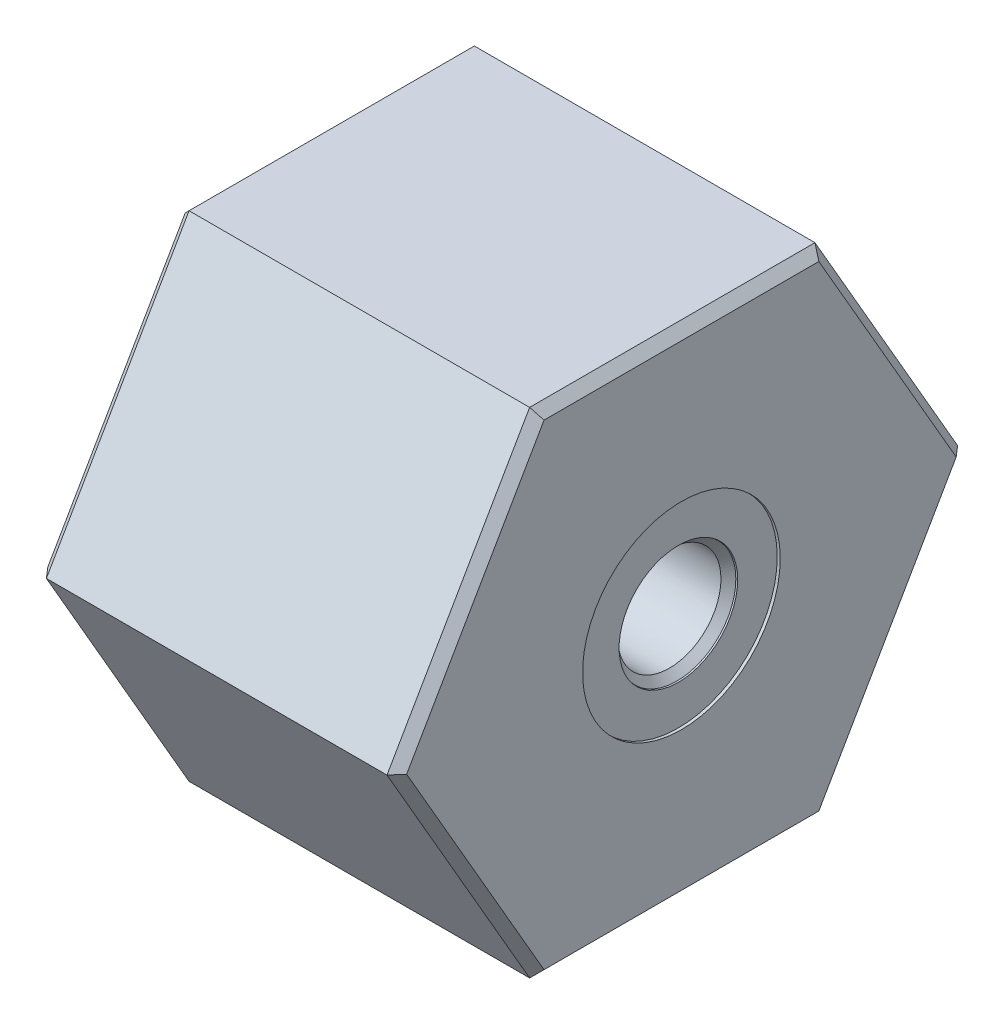
ISO-10303-21;
HEADER;
FILE_DESCRIPTION(('STEP AP214'),'2;1');
FILE_NAME('part.step','',(''),(''),'','','');
FILE_SCHEMA(('AUTOMOTIVE_DESIGN { 1 0 10303 214 1 1 1 1 }'));
ENDSEC;
DATA;
#1=APPLICATION_CONTEXT('core data for automotive mechanical design processes');
#2=APPLICATION_PROTOCOL_DEFINITION('international standard','automotive_design',2000,#1);
#3=PRODUCT_CONTEXT('',#1,'mechanical');
#4=PRODUCT('Part','Part','',(#3));
#5=PRODUCT_RELATED_PRODUCT_CATEGORY('part','',(#4));
#6=PRODUCT_DEFINITION_FORMATION('','',#4);
#7=PRODUCT_DEFINITION_CONTEXT('part definition',#1,'design');
#8=PRODUCT_DEFINITION('design','',#6,#7);
#9=PRODUCT_DEFINITION_SHAPE('','',#8);
#10=(LENGTH_UNIT() NAMED_UNIT(*) SI_UNIT(.MILLI.,.METRE.));
#11=(NAMED_UNIT(*) PLANE_ANGLE_UNIT() SI_UNIT($,.RADIAN.));
#12=(NAMED_UNIT(*) SI_UNIT($,.STERADIAN.) SOLID_ANGLE_UNIT());
#13=UNCERTAINTY_MEASURE_WITH_UNIT(LENGTH_MEASURE(1.E-05),#10,'distance_accuracy_value','');
#14=(GEOMETRIC_REPRESENTATION_CONTEXT(3) GLOBAL_UNCERTAINTY_ASSIGNED_CONTEXT((#13)) GLOBAL_UNIT_ASSIGNED_CONTEXT((#10,
#11,#12)) REPRESENTATION_CONTEXT('',''));
#15=CARTESIAN_POINT('',(0.,0.,0.));
#16=DIRECTION('',(0.,0.,1.));
#17=DIRECTION('',(1.,0.,0.));
#18=AXIS2_PLACEMENT_3D('',#15,#16,#17);
#19=CARTESIAN_POINT('',(29.972,0.,-23.8301323608018));
#20=DIRECTION('',(0.,-0.5,0.866025403784439));
#21=DIRECTION('',(0.,-0.866025403784439,-0.5));
#22=AXIS2_PLACEMENT_3D('',#19,#20,#21);
#23=PLANE('',#22);
#24=DIRECTION('',(-1.,0.,0.));
#25=VECTOR('',#24,1.);
#26=CARTESIAN_POINT('',(29.972,20.6375,-11.9150661804009));
#27=LINE('',#26,#25);
#28=CARTESIAN_POINT('',(29.21,20.6375,-11.9150661804009));
#29=VERTEX_POINT('',#28);
#30=CARTESIAN_POINT('',(0.761999999999999,20.6375,-11.9150661804009));
#31=VERTEX_POINT('',#30);
#32=EDGE_CURVE('E122',#29,#31,#27,.T.);
#33=ORIENTED_EDGE('',*,*,#32,.F.);
#34=DIRECTION('',(0.,-0.866025403784439,-0.5));
#35=VECTOR('',#34,1.);
#36=CARTESIAN_POINT('',(29.21,0.,-23.8301323608018));
#37=LINE('',#36,#35);
#38=CARTESIAN_POINT('',(29.21,0.,-23.8301323608018));
#39=VERTEX_POINT('',#38);
#40=EDGE_CURVE('E212',#29,#39,#37,.T.);
#41=ORIENTED_EDGE('',*,*,#40,.T.);
#42=DIRECTION('',(-1.,0.,0.));
#43=VECTOR('',#42,1.);
#44=CARTESIAN_POINT('',(29.972,0.,-23.8301323608018));
#45=LINE('',#44,#43);
#46=CARTESIAN_POINT('',(0.761999999999999,0.,-23.8301323608018));
#47=VERTEX_POINT('',#46);
#48=EDGE_CURVE('E159',#39,#47,#45,.T.);
#49=ORIENTED_EDGE('',*,*,#48,.T.);
#50=DIRECTION('',(0.,0.866025403784439,0.5));
#51=VECTOR('',#50,1.);
#52=CARTESIAN_POINT('',(0.761999999999999,0.,-23.8301323608018));
#53=LINE('',#52,#51);
#54=EDGE_CURVE('E143',#47,#31,#53,.T.);
#55=ORIENTED_EDGE('',*,*,#54,.T.);
#56=EDGE_LOOP('',(#33,#41,#49,#55));
#57=FACE_BOUND('',#56,.T.);
#58=ADVANCED_FACE('F32',(#57),#23,.F.);
#59=CARTESIAN_POINT('',(29.972,20.6375,-11.9150661804009));
#60=DIRECTION('',(0.,-1.,0.));
#61=DIRECTION('',(0.,0.,-1.));
#62=AXIS2_PLACEMENT_3D('',#59,#60,#61);
#63=PLANE('',#62);
#64=DIRECTION('',(-1.,0.,0.));
#65=VECTOR('',#64,1.);
#66=CARTESIAN_POINT('',(29.972,20.6375,11.9150661804009));
#67=LINE('',#66,#65);
#68=CARTESIAN_POINT('',(29.21,20.6375,11.9150661804009));
#69=VERTEX_POINT('',#68);
#70=CARTESIAN_POINT('',(0.761999999999999,20.6375,11.9150661804009));
#71=VERTEX_POINT('',#70);
#72=EDGE_CURVE('E135',#69,#71,#67,.T.);
#73=ORIENTED_EDGE('',*,*,#72,.F.);
#74=DIRECTION('',(0.,0.,-1.));
#75=VECTOR('',#74,1.);
#76=CARTESIAN_POINT('',(29.21,20.6375,-11.9150661804009));
#77=LINE('',#76,#75);
#78=EDGE_CURVE('E129',#69,#29,#77,.T.);
#79=ORIENTED_EDGE('',*,*,#78,.T.);
#80=ORIENTED_EDGE('',*,*,#32,.T.);
#81=DIRECTION('',(0.,0.,1.));
#82=VECTOR('',#81,1.);
#83=CARTESIAN_POINT('',(0.761999999999999,20.6375,-11.9150661804009));
#84=LINE('',#83,#82);
#85=EDGE_CURVE('E126',#31,#71,#84,.T.);
#86=ORIENTED_EDGE('',*,*,#85,.T.);
#87=EDGE_LOOP('',(#73,#79,#80,#86));
#88=FACE_BOUND('',#87,.T.);
#89=ADVANCED_FACE('F124',(#88),#63,.F.);
#90=CARTESIAN_POINT('',(29.972,20.6375,11.9150661804009));
#91=DIRECTION('',(0.,-0.5,-0.866025403784439));
#92=DIRECTION('',(0.,0.866025403784439,-0.5));
#93=AXIS2_PLACEMENT_3D('',#90,#91,#92);
#94=PLANE('',#93);
#95=DIRECTION('',(-1.,0.,0.));
#96=VECTOR('',#95,1.);
#97=CARTESIAN_POINT('',(29.972,0.,23.8301323608018));
#98=LINE('',#97,#96);
#99=CARTESIAN_POINT('',(29.21,0.,23.8301323608018));
#100=VERTEX_POINT('',#99);
#101=CARTESIAN_POINT('',(0.761999999999999,0.,23.8301323608018));
#102=VERTEX_POINT('',#101);
#103=EDGE_CURVE('E330',#100,#102,#98,.T.);
#104=ORIENTED_EDGE('',*,*,#103,.F.);
#105=DIRECTION('',(0.,0.866025403784439,-0.5));
#106=VECTOR('',#105,1.);
#107=CARTESIAN_POINT('',(29.21,20.6375,11.9150661804009));
#108=LINE('',#107,#106);
#109=EDGE_CURVE('E54',#100,#69,#108,.T.);
#110=ORIENTED_EDGE('',*,*,#109,.T.);
#111=ORIENTED_EDGE('',*,*,#72,.T.);
#112=DIRECTION('',(0.,-0.866025403784439,0.5));
#113=VECTOR('',#112,1.);
#114=CARTESIAN_POINT('',(0.761999999999995,20.6375,11.9150661804009));
#115=LINE('',#114,#113);
#116=EDGE_CURVE('E156',#71,#102,#115,.T.);
#117=ORIENTED_EDGE('',*,*,#116,.T.);
#118=EDGE_LOOP('',(#104,#110,#111,#117));
#119=FACE_BOUND('',#118,.T.);
#120=ADVANCED_FACE('F256',(#119),#94,.F.);
#121=CARTESIAN_POINT('',(29.972,0.,23.8301323608018));
#122=DIRECTION('',(0.,0.5,-0.866025403784439));
#123=DIRECTION('',(0.,0.866025403784439,0.5));
#124=AXIS2_PLACEMENT_3D('',#121,#122,#123);
#125=PLANE('',#124);
#126=DIRECTION('',(-1.,0.,0.));
#127=VECTOR('',#126,1.);
#128=CARTESIAN_POINT('',(29.972,-20.6375,11.9150661804009));
#129=LINE('',#128,#127);
#130=CARTESIAN_POINT('',(29.21,-20.6375,11.9150661804009));
#131=VERTEX_POINT('',#130);
#132=CARTESIAN_POINT('',(0.761999999999999,-20.6375,11.9150661804009));
#133=VERTEX_POINT('',#132);
#134=EDGE_CURVE('E322',#131,#133,#129,.T.);
#135=ORIENTED_EDGE('',*,*,#134,.F.);
#136=DIRECTION('',(0.,0.866025403784439,0.5));
#137=VECTOR('',#136,1.);
#138=CARTESIAN_POINT('',(29.21,0.,23.8301323608018));
#139=LINE('',#138,#137);
#140=EDGE_CURVE('E47',#131,#100,#139,.T.);
#141=ORIENTED_EDGE('',*,*,#140,.T.);
#142=ORIENTED_EDGE('',*,*,#103,.T.);
#143=DIRECTION('',(0.,-0.866025403784439,-0.5));
#144=VECTOR('',#143,1.);
#145=CARTESIAN_POINT('',(0.761999999999999,0.,23.8301323608018));
#146=LINE('',#145,#144);
#147=EDGE_CURVE('E183',#102,#133,#146,.T.);
#148=ORIENTED_EDGE('',*,*,#147,.T.);
#149=EDGE_LOOP('',(#135,#141,#142,#148));
#150=FACE_BOUND('',#149,.T.);
#151=ADVANCED_FACE('F355',(#150),#125,.F.);
#152=CARTESIAN_POINT('',(29.972,-20.6375,11.9150661804009));
#153=DIRECTION('',(0.,1.,0.));
#154=DIRECTION('',(0.,0.,1.));
#155=AXIS2_PLACEMENT_3D('',#152,#153,#154);
#156=PLANE('',#155);
#157=DIRECTION('',(-1.,0.,0.));
#158=VECTOR('',#157,1.);
#159=CARTESIAN_POINT('',(29.972,-20.6375,-11.9150661804009));
#160=LINE('',#159,#158);
#161=CARTESIAN_POINT('',(29.21,-20.6375,-11.9150661804009));
#162=VERTEX_POINT('',#161);
#163=CARTESIAN_POINT('',(0.761999999999999,-20.6375,-11.9150661804009));
#164=VERTEX_POINT('',#163);
#165=EDGE_CURVE('E319',#162,#164,#160,.T.);
#166=ORIENTED_EDGE('',*,*,#165,.F.);
#167=DIRECTION('',(0.,0.,1.));
#168=VECTOR('',#167,1.);
#169=CARTESIAN_POINT('',(29.21,-20.6375,11.9150661804009));
#170=LINE('',#169,#168);
#171=EDGE_CURVE('E216',#162,#131,#170,.T.);
#172=ORIENTED_EDGE('',*,*,#171,.T.);
#173=ORIENTED_EDGE('',*,*,#134,.T.);
#174=DIRECTION('',(0.,0.,-1.));
#175=VECTOR('',#174,1.);
#176=CARTESIAN_POINT('',(0.761999999999999,-20.6375,11.9150661804009));
#177=LINE('',#176,#175);
#178=EDGE_CURVE('E180',#133,#164,#177,.T.);
#179=ORIENTED_EDGE('',*,*,#178,.T.);
#180=EDGE_LOOP('',(#166,#172,#173,#179));
#181=FACE_BOUND('',#180,.T.);
#182=ADVANCED_FACE('F352',(#181),#156,.F.);
#183=CARTESIAN_POINT('',(29.972,-20.6375,-11.9150661804009));
#184=DIRECTION('',(0.,0.5,0.866025403784439));
#185=DIRECTION('',(0.,-0.866025403784439,0.5));
#186=AXIS2_PLACEMENT_3D('',#183,#184,#185);
#187=PLANE('',#186);
#188=ORIENTED_EDGE('',*,*,#48,.F.);
#189=DIRECTION('',(0.,-0.866025403784439,0.5));
#190=VECTOR('',#189,1.);
#191=CARTESIAN_POINT('',(29.21,-20.6375,-11.9150661804009));
#192=LINE('',#191,#190);
#193=EDGE_CURVE('E214',#39,#162,#192,.T.);
#194=ORIENTED_EDGE('',*,*,#193,.T.);
#195=ORIENTED_EDGE('',*,*,#165,.T.);
#196=DIRECTION('',(0.,0.866025403784439,-0.5));
#197=VECTOR('',#196,1.);
#198=CARTESIAN_POINT('',(0.761999999999999,-20.6375,-11.9150661804009));
#199=LINE('',#198,#197);
#200=EDGE_CURVE('E178',#164,#47,#199,.T.);
#201=ORIENTED_EDGE('',*,*,#200,.T.);
#202=EDGE_LOOP('',(#188,#194,#195,#201));
#203=FACE_BOUND('',#202,.T.);
#204=ADVANCED_FACE('F315',(#203),#187,.F.);
#205=CARTESIAN_POINT('',(29.972,20.6375,-11.9150661804009));
#206=DIRECTION('',(1.,0.,0.));
#207=DIRECTION('',(0.,0.,-1.));
#208=AXIS2_PLACEMENT_3D('',#205,#206,#207);
#209=PLANE('',#208);
#210=DIRECTION('',(0.,0.866025403784439,-0.5));
#211=VECTOR('',#210,1.);
#212=CARTESIAN_POINT('',(29.972,0.380999999999997,-23.1702210031181));
#213=LINE('',#212,#211);
#214=CARTESIAN_POINT('',(29.972,-19.8755,-11.4751252752784));
#215=VERTEX_POINT('',#214);
#216=CARTESIAN_POINT('',(29.972,0.,-22.9502505505568));
#217=VERTEX_POINT('',#216);
#218=EDGE_CURVE('E207',#215,#217,#213,.T.);
#219=ORIENTED_EDGE('',*,*,#218,.T.);
#220=DIRECTION('',(0.,0.866025403784439,0.5));
#221=VECTOR('',#220,1.);
#222=CARTESIAN_POINT('',(29.972,20.2565,-11.2551548227172));
#223=LINE('',#222,#221);
#224=CARTESIAN_POINT('',(29.972,19.8755,-11.4751252752784));
#225=VERTEX_POINT('',#224);
#226=EDGE_CURVE('E209',#217,#225,#223,.T.);
#227=ORIENTED_EDGE('',*,*,#226,.T.);
#228=DIRECTION('',(0.,0.,1.));
#229=VECTOR('',#228,1.);
#230=CARTESIAN_POINT('',(29.972,19.8755,11.9150661804009));
#231=LINE('',#230,#229);
#232=CARTESIAN_POINT('',(29.972,19.8755,11.4751252752784));
#233=VERTEX_POINT('',#232);
#234=EDGE_CURVE('E203',#225,#233,#231,.T.);
#235=ORIENTED_EDGE('',*,*,#234,.T.);
#236=DIRECTION('',(0.,-0.866025403784439,0.5));
#237=VECTOR('',#236,1.);
#238=CARTESIAN_POINT('',(29.972,-0.381,23.1702210031181));
#239=LINE('',#238,#237);
#240=CARTESIAN_POINT('',(29.972,0.,22.9502505505568));
#241=VERTEX_POINT('',#240);
#242=EDGE_CURVE('E201',#233,#241,#239,.T.);
#243=ORIENTED_EDGE('',*,*,#242,.T.);
#244=DIRECTION('',(0.,-0.866025403784439,-0.5));
#245=VECTOR('',#244,1.);
#246=CARTESIAN_POINT('',(29.972,-20.2565,11.2551548227172));
#247=LINE('',#246,#245);
#248=CARTESIAN_POINT('',(29.972,-19.8755,11.4751252752784));
#249=VERTEX_POINT('',#248);
#250=EDGE_CURVE('E155',#241,#249,#247,.T.);
#251=ORIENTED_EDGE('',*,*,#250,.T.);
#252=DIRECTION('',(0.,0.,-1.));
#253=VECTOR('',#252,1.);
#254=CARTESIAN_POINT('',(29.972,-19.8755,-11.9150661804009));
#255=LINE('',#254,#253);
#256=EDGE_CURVE('E205',#249,#215,#255,.T.);
#257=ORIENTED_EDGE('',*,*,#256,.T.);
#258=EDGE_LOOP('',(#219,#227,#235,#243,#251,#257));
#259=FACE_BOUND('',#258,.T.);
#260=CARTESIAN_POINT('',(29.972,0.,0.));
#261=DIRECTION('',(1.,0.,0.));
#262=DIRECTION('',(0.,0.,-1.));
#263=AXIS2_PLACEMENT_3D('',#260,#261,#262);
#264=CIRCLE('',#263,8.255);
#265=CARTESIAN_POINT('',(29.972,0.,-8.255));
#266=VERTEX_POINT('',#265);
#267=EDGE_CURVE('E320',#266,#266,#264,.T.);
#268=ORIENTED_EDGE('',*,*,#267,.F.);
#269=EDGE_LOOP('',(#268));
#270=FACE_BOUND('',#269,.T.);
#271=ADVANCED_FACE('F338',(#259,#270),#209,.T.);
#272=CARTESIAN_POINT('',(0.,20.6375,-11.9150661804009));
#273=DIRECTION('',(1.,0.,0.));
#274=DIRECTION('',(0.,0.,-1.));
#275=AXIS2_PLACEMENT_3D('',#272,#273,#274);
#276=PLANE('',#275);
#277=DIRECTION('',(0.,0.,-1.));
#278=VECTOR('',#277,1.);
#279=CARTESIAN_POINT('',(0.,19.8755,-11.9150661804009));
#280=LINE('',#279,#278);
#281=CARTESIAN_POINT('',(0.,19.8755,11.4751252752784));
#282=VERTEX_POINT('',#281);
#283=CARTESIAN_POINT('',(0.,19.8755,-11.4751252752784));
#284=VERTEX_POINT('',#283);
#285=EDGE_CURVE('E161',#282,#284,#280,.T.);
#286=ORIENTED_EDGE('',*,*,#285,.T.);
#287=DIRECTION('',(0.,-0.866025403784439,-0.5));
#288=VECTOR('',#287,1.);
#289=CARTESIAN_POINT('',(0.,20.2565,-11.2551548227172));
#290=LINE('',#289,#288);
#291=CARTESIAN_POINT('',(0.,0.,-22.9502505505568));
#292=VERTEX_POINT('',#291);
#293=EDGE_CURVE('E145',#284,#292,#290,.T.);
#294=ORIENTED_EDGE('',*,*,#293,.T.);
#295=DIRECTION('',(0.,-0.866025403784439,0.5));
#296=VECTOR('',#295,1.);
#297=CARTESIAN_POINT('',(0.,10.69975,-29.1277540933185));
#298=LINE('',#297,#296);
#299=CARTESIAN_POINT('',(0.,-19.8755,-11.4751252752784));
#300=VERTEX_POINT('',#299);
#301=EDGE_CURVE('E175',#292,#300,#298,.T.);
#302=ORIENTED_EDGE('',*,*,#301,.T.);
#303=DIRECTION('',(0.,0.,1.));
#304=VECTOR('',#303,1.);
#305=CARTESIAN_POINT('',(0.,-19.8755,-11.9150661804009));
#306=LINE('',#305,#304);
#307=CARTESIAN_POINT('',(0.,-19.8755,11.4751252752784));
#308=VERTEX_POINT('',#307);
#309=EDGE_CURVE('E173',#300,#308,#306,.T.);
#310=ORIENTED_EDGE('',*,*,#309,.T.);
#311=DIRECTION('',(0.,0.866025403784439,0.5));
#312=VECTOR('',#311,1.);
#313=CARTESIAN_POINT('',(0.,0.380999999999999,23.1702210031181));
#314=LINE('',#313,#312);
#315=CARTESIAN_POINT('',(0.,0.,22.9502505505568));
#316=VERTEX_POINT('',#315);
#317=EDGE_CURVE('E171',#308,#316,#314,.T.);
#318=ORIENTED_EDGE('',*,*,#317,.T.);
#319=DIRECTION('',(0.,0.866025403784439,-0.5));
#320=VECTOR('',#319,1.);
#321=CARTESIAN_POINT('',(0.,30.57525,5.29762173251672));
#322=LINE('',#321,#320);
#323=EDGE_CURVE('E164',#316,#282,#322,.T.);
#324=ORIENTED_EDGE('',*,*,#323,.T.);
#325=EDGE_LOOP('',(#286,#294,#302,#310,#318,#324));
#326=FACE_BOUND('',#325,.T.);
#327=CARTESIAN_POINT('',(0.,0.,0.));
#328=DIRECTION('',(1.,0.,0.));
#329=DIRECTION('',(0.,0.,-1.));
#330=AXIS2_PLACEMENT_3D('',#327,#328,#329);
#331=CIRCLE('',#330,17.2593);
#332=CARTESIAN_POINT('',(0.,0.,-17.2593));
#333=VERTEX_POINT('',#332);
#334=EDGE_CURVE('E134',#333,#333,#331,.T.);
#335=ORIENTED_EDGE('',*,*,#334,.T.);
#336=EDGE_LOOP('',(#335));
#337=FACE_BOUND('',#336,.T.);
#338=ADVANCED_FACE('F335',(#326,#337),#276,.F.);
#339=CARTESIAN_POINT('',(0.,0.,0.));
#340=DIRECTION('',(1.,0.,0.));
#341=DIRECTION('',(0.,0.,-1.));
#342=AXIS2_PLACEMENT_3D('',#339,#340,#341);
#343=CYLINDRICAL_SURFACE('',#342,16.7513);
#344=CARTESIAN_POINT('',(15.9512,0.,0.));
#345=DIRECTION('',(1.,0.,0.));
#346=DIRECTION('',(0.,0.,-1.));
#347=AXIS2_PLACEMENT_3D('',#344,#345,#346);
#348=CIRCLE('',#347,16.7513);
#349=CARTESIAN_POINT('',(15.9512,0.,-16.7513));
#350=VERTEX_POINT('',#349);
#351=EDGE_CURVE('E40',#350,#350,#348,.T.);
#352=ORIENTED_EDGE('',*,*,#351,.T.);
#353=EDGE_LOOP('',(#352));
#354=FACE_BOUND('',#353,.T.);
#355=CARTESIAN_POINT('',(0.508000000000019,0.,0.));
#356=DIRECTION('',(1.,0.,0.));
#357=DIRECTION('',(0.,0.,-1.));
#358=AXIS2_PLACEMENT_3D('',#355,#356,#357);
#359=CIRCLE('',#358,16.7513);
#360=CARTESIAN_POINT('',(0.508000000000019,0.,-16.7513));
#361=VERTEX_POINT('',#360);
#362=EDGE_CURVE('E162',#361,#361,#359,.F.);
#363=ORIENTED_EDGE('',*,*,#362,.T.);
#364=EDGE_LOOP('',(#363));
#365=FACE_BOUND('',#364,.T.);
#366=ADVANCED_FACE('F238',(#354,#365),#343,.F.);
#367=CARTESIAN_POINT('',(0.,0.,0.));
#368=DIRECTION('',(1.,0.,0.));
#369=DIRECTION('',(0.,0.,-1.));
#370=AXIS2_PLACEMENT_3D('',#367,#368,#369);
#371=CYLINDRICAL_SURFACE('',#370,8.255);
#372=CARTESIAN_POINT('',(29.718,0.,0.));
#373=DIRECTION('',(1.,0.,0.));
#374=DIRECTION('',(0.,0.,-1.));
#375=AXIS2_PLACEMENT_3D('',#372,#373,#374);
#376=CIRCLE('',#375,8.255);
#377=CARTESIAN_POINT('',(29.718,0.,-8.255));
#378=VERTEX_POINT('',#377);
#379=EDGE_CURVE('E325',#378,#378,#376,.T.);
#380=ORIENTED_EDGE('',*,*,#379,.F.);
#381=EDGE_LOOP('',(#380));
#382=FACE_BOUND('',#381,.T.);
#383=ORIENTED_EDGE('',*,*,#267,.T.);
#384=EDGE_LOOP('',(#383));
#385=FACE_BOUND('',#384,.T.);
#386=ADVANCED_FACE('F345',(#382,#385),#371,.F.);
#387=CARTESIAN_POINT('',(29.718,8.255,0.));
#388=DIRECTION('',(-1.,0.,0.));
#389=DIRECTION('',(0.,0.,1.));
#390=AXIS2_PLACEMENT_3D('',#387,#388,#389);
#391=PLANE('',#390);
#392=CARTESIAN_POINT('',(29.718,0.,0.));
#393=DIRECTION('',(1.,0.,0.));
#394=DIRECTION('',(0.,0.,-1.));
#395=AXIS2_PLACEMENT_3D('',#392,#393,#394);
#396=CIRCLE('',#395,4.953);
#397=CARTESIAN_POINT('',(29.718,0.,-4.953));
#398=VERTEX_POINT('',#397);
#399=EDGE_CURVE('E434',#398,#398,#396,.T.);
#400=ORIENTED_EDGE('',*,*,#399,.F.);
#401=EDGE_LOOP('',(#400));
#402=FACE_BOUND('',#401,.T.);
#403=ORIENTED_EDGE('',*,*,#379,.T.);
#404=EDGE_LOOP('',(#403));
#405=FACE_BOUND('',#404,.T.);
#406=ADVANCED_FACE('F376',(#402,#405),#391,.F.);
#407=CARTESIAN_POINT('',(29.718,0.,0.));
#408=DIRECTION('',(1.,0.,0.));
#409=DIRECTION('',(0.,0.,-1.));
#410=AXIS2_PLACEMENT_3D('',#407,#408,#409);
#411=CONICAL_SURFACE('',#410,4.953,0.20943951023931);
#412=CARTESIAN_POINT('',(29.591,0.,0.));
#413=DIRECTION('',(1.,0.,0.));
#414=DIRECTION('',(0.,0.,-1.));
#415=AXIS2_PLACEMENT_3D('',#412,#413,#414);
#416=CIRCLE('',#415,4.92600531666791);
#417=CARTESIAN_POINT('',(29.591,0.,-4.92600531666791));
#418=VERTEX_POINT('',#417);
#419=EDGE_CURVE('E431',#418,#418,#416,.T.);
#420=ORIENTED_EDGE('',*,*,#419,.F.);
#421=EDGE_LOOP('',(#420));
#422=FACE_BOUND('',#421,.T.);
#423=ORIENTED_EDGE('',*,*,#399,.T.);
#424=EDGE_LOOP('',(#423));
#425=FACE_BOUND('',#424,.T.);
#426=ADVANCED_FACE('F382',(#422,#425),#411,.F.);
#427=CARTESIAN_POINT('',(29.591,0.,0.));
#428=DIRECTION('',(1.,0.,0.));
#429=DIRECTION('',(0.,0.,-1.));
#430=AXIS2_PLACEMENT_3D('',#427,#428,#429);
#431=CONICAL_SURFACE('',#430,4.92600531666791,0.785398163397456);
#432=CARTESIAN_POINT('',(28.9702946833321,0.,0.));
#433=DIRECTION('',(1.,0.,0.));
#434=DIRECTION('',(0.,0.,-1.));
#435=AXIS2_PLACEMENT_3D('',#432,#433,#434);
#436=CIRCLE('',#435,4.3053);
#437=CARTESIAN_POINT('',(28.9702946833321,0.,-4.3053));
#438=VERTEX_POINT('',#437);
#439=EDGE_CURVE('E428',#438,#438,#436,.T.);
#440=ORIENTED_EDGE('',*,*,#439,.F.);
#441=EDGE_LOOP('',(#440));
#442=FACE_BOUND('',#441,.T.);
#443=ORIENTED_EDGE('',*,*,#419,.T.);
#444=EDGE_LOOP('',(#443));
#445=FACE_BOUND('',#444,.T.);
#446=ADVANCED_FACE('F389',(#442,#445),#431,.F.);
#447=CARTESIAN_POINT('',(0.,0.,0.));
#448=DIRECTION('',(1.,0.,0.));
#449=DIRECTION('',(0.,0.,-1.));
#450=AXIS2_PLACEMENT_3D('',#447,#448,#449);
#451=CYLINDRICAL_SURFACE('',#450,4.3053);
#452=CARTESIAN_POINT('',(22.2504,0.,0.));
#453=DIRECTION('',(1.,0.,0.));
#454=DIRECTION('',(0.,0.,-1.));
#455=AXIS2_PLACEMENT_3D('',#452,#453,#454);
#456=CIRCLE('',#455,4.3053);
#457=CARTESIAN_POINT('',(22.2504,0.,-4.3053));
#458=VERTEX_POINT('',#457);
#459=EDGE_CURVE('E425',#458,#458,#456,.T.);
#460=ORIENTED_EDGE('',*,*,#459,.F.);
#461=EDGE_LOOP('',(#460));
#462=FACE_BOUND('',#461,.T.);
#463=ORIENTED_EDGE('',*,*,#439,.T.);
#464=EDGE_LOOP('',(#463));
#465=FACE_BOUND('',#464,.T.);
#466=ADVANCED_FACE('F393',(#462,#465),#451,.F.);
#467=CARTESIAN_POINT('',(22.2504,0.,0.));
#468=DIRECTION('',(-1.,0.,0.));
#469=DIRECTION('',(0.,0.,1.));
#470=AXIS2_PLACEMENT_3D('',#467,#468,#469);
#471=CONICAL_SURFACE('',#470,4.3053,0.78539816339745);
#472=CARTESIAN_POINT('',(21.4884,0.,0.));
#473=DIRECTION('',(1.,0.,0.));
#474=DIRECTION('',(0.,0.,-1.));
#475=AXIS2_PLACEMENT_3D('',#472,#473,#474);
#476=CIRCLE('',#475,5.0673);
#477=CARTESIAN_POINT('',(21.4884,0.,-5.0673));
#478=VERTEX_POINT('',#477);
#479=EDGE_CURVE('E420',#478,#478,#476,.T.);
#480=ORIENTED_EDGE('',*,*,#479,.F.);
#481=EDGE_LOOP('',(#480));
#482=FACE_BOUND('',#481,.T.);
#483=ORIENTED_EDGE('',*,*,#459,.T.);
#484=EDGE_LOOP('',(#483));
#485=FACE_BOUND('',#484,.T.);
#486=ADVANCED_FACE('F397',(#482,#485),#471,.F.);
#487=CARTESIAN_POINT('',(21.4884,14.9352,0.));
#488=DIRECTION('',(1.,0.,0.));
#489=DIRECTION('',(0.,0.,-1.));
#490=AXIS2_PLACEMENT_3D('',#487,#488,#489);
#491=PLANE('',#490);
#492=CARTESIAN_POINT('',(21.4884,0.,0.));
#493=DIRECTION('',(1.,0.,0.));
#494=DIRECTION('',(0.,0.,-1.));
#495=AXIS2_PLACEMENT_3D('',#492,#493,#494);
#496=CIRCLE('',#495,14.9352);
#497=CARTESIAN_POINT('',(21.4884,0.,-14.9352));
#498=VERTEX_POINT('',#497);
#499=EDGE_CURVE('E417',#498,#498,#496,.T.);
#500=ORIENTED_EDGE('',*,*,#499,.F.);
#501=EDGE_LOOP('',(#500));
#502=FACE_BOUND('',#501,.T.);
#503=ORIENTED_EDGE('',*,*,#479,.T.);
#504=EDGE_LOOP('',(#503));
#505=FACE_BOUND('',#504,.T.);
#506=ADVANCED_FACE('F401',(#502,#505),#491,.F.);
#507=CARTESIAN_POINT('',(0.,0.,0.));
#508=DIRECTION('',(1.,0.,0.));
#509=DIRECTION('',(0.,0.,-1.));
#510=AXIS2_PLACEMENT_3D('',#507,#508,#509);
#511=CYLINDRICAL_SURFACE('',#510,14.9352);
#512=CARTESIAN_POINT('',(16.4592,0.,0.));
#513=DIRECTION('',(1.,0.,0.));
#514=DIRECTION('',(0.,0.,-1.));
#515=AXIS2_PLACEMENT_3D('',#512,#513,#514);
#516=CIRCLE('',#515,14.9352);
#517=CARTESIAN_POINT('',(16.4592,0.,-14.9352));
#518=VERTEX_POINT('',#517);
#519=EDGE_CURVE('E199',#518,#518,#516,.T.);
#520=ORIENTED_EDGE('',*,*,#519,.F.);
#521=EDGE_LOOP('',(#520));
#522=FACE_BOUND('',#521,.T.);
#523=ORIENTED_EDGE('',*,*,#499,.T.);
#524=EDGE_LOOP('',(#523));
#525=FACE_BOUND('',#524,.T.);
#526=ADVANCED_FACE('F405',(#522,#525),#511,.F.);
#527=CARTESIAN_POINT('',(16.4592,14.9352,0.));
#528=DIRECTION('',(1.,0.,0.));
#529=DIRECTION('',(0.,0.,-1.));
#530=AXIS2_PLACEMENT_3D('',#527,#528,#529);
#531=PLANE('',#530);
#532=CARTESIAN_POINT('',(16.4592,0.,0.));
#533=DIRECTION('',(1.,0.,0.));
#534=DIRECTION('',(0.,0.,-1.));
#535=AXIS2_PLACEMENT_3D('',#532,#533,#534);
#536=CIRCLE('',#535,16.2433);
#537=CARTESIAN_POINT('',(16.4592,0.,-16.2433));
#538=VERTEX_POINT('',#537);
#539=EDGE_CURVE('E11',#538,#538,#536,.F.);
#540=ORIENTED_EDGE('',*,*,#539,.T.);
#541=EDGE_LOOP('',(#540));
#542=FACE_BOUND('',#541,.T.);
#543=ORIENTED_EDGE('',*,*,#519,.T.);
#544=EDGE_LOOP('',(#543));
#545=FACE_BOUND('',#544,.T.);
#546=ADVANCED_FACE('F264',(#542,#545),#531,.F.);
#547=CARTESIAN_POINT('',(0.,0.,0.));
#548=DIRECTION('',(-1.,0.,0.));
#549=DIRECTION('',(0.,0.,1.));
#550=AXIS2_PLACEMENT_3D('',#547,#548,#549);
#551=CONICAL_SURFACE('',#550,17.2593,0.785398163397448);
#552=ORIENTED_EDGE('',*,*,#362,.F.);
#553=EDGE_LOOP('',(#552));
#554=FACE_BOUND('',#553,.T.);
#555=ORIENTED_EDGE('',*,*,#334,.F.);
#556=EDGE_LOOP('',(#555));
#557=FACE_BOUND('',#556,.T.);
#558=ADVANCED_FACE('F260',(#554,#557),#551,.F.);
#559=CARTESIAN_POINT('',(0.761999999999999,0.,23.8301323608018));
#560=DIRECTION('',(0.707106781186544,0.353553390593276,-0.612372435695798));
#561=DIRECTION('',(-0.654653670707981,0.,-0.755928946018451));
#562=AXIS2_PLACEMENT_3D('',#559,#560,#561);
#563=PLANE('',#562);
#564=DIRECTION('',(0.654653670707981,0.,0.755928946018451));
#565=VECTOR('',#564,1.);
#566=CARTESIAN_POINT('',(-5.13442857142856,0.,17.0215231148585));
#567=LINE('',#566,#565);
#568=EDGE_CURVE('E193',#316,#102,#567,.T.);
#569=ORIENTED_EDGE('',*,*,#568,.F.);
#570=ORIENTED_EDGE('',*,*,#317,.F.);
#571=DIRECTION('',(0.654653670707981,-0.654653670707975,0.377964473009224));
#572=VECTOR('',#571,1.);
#573=CARTESIAN_POINT('',(-5.1344285714286,-14.7410714285715,8.51076155742924));
#574=LINE('',#573,#572);
#575=EDGE_CURVE('E196',#133,#308,#574,.F.);
#576=ORIENTED_EDGE('',*,*,#575,.F.);
#577=ORIENTED_EDGE('',*,*,#147,.F.);
#578=EDGE_LOOP('',(#569,#570,#576,#577));
#579=FACE_BOUND('',#578,.T.);
#580=ADVANCED_FACE('F263',(#579),#563,.F.);
#581=CARTESIAN_POINT('',(0.761999999999999,-20.6375,11.9150661804009));
#582=DIRECTION('',(0.707106781186544,0.707106781186551,0.));
#583=DIRECTION('',(-0.707106781186551,0.707106781186544,0.));
#584=AXIS2_PLACEMENT_3D('',#581,#582,#583);
#585=PLANE('',#584);
#586=ORIENTED_EDGE('',*,*,#575,.T.);
#587=ORIENTED_EDGE('',*,*,#309,.F.);
#588=DIRECTION('',(0.65465367070798,-0.654653670707974,-0.377964473009229));
#589=VECTOR('',#588,1.);
#590=CARTESIAN_POINT('',(-5.13442857142862,-14.7410714285714,-8.51076155742918));
#591=LINE('',#590,#589);
#592=EDGE_CURVE('E190',#164,#300,#591,.F.);
#593=ORIENTED_EDGE('',*,*,#592,.F.);
#594=ORIENTED_EDGE('',*,*,#178,.F.);
#595=EDGE_LOOP('',(#586,#587,#593,#594));
#596=FACE_BOUND('',#595,.T.);
#597=ADVANCED_FACE('F278',(#596),#585,.F.);
#598=CARTESIAN_POINT('',(0.761999999999999,20.6375,11.9150661804009));
#599=DIRECTION('',(0.707106781186544,-0.353553390593275,-0.612372435695797));
#600=DIRECTION('',(-0.654653670707981,0.,-0.755928946018451));
#601=AXIS2_PLACEMENT_3D('',#598,#599,#600);
#602=PLANE('',#601);
#603=ORIENTED_EDGE('',*,*,#568,.T.);
#604=ORIENTED_EDGE('',*,*,#116,.F.);
#605=DIRECTION('',(0.654653670707981,0.654653670707975,0.377964473009226));
#606=VECTOR('',#605,1.);
#607=CARTESIAN_POINT('',(-5.13442857142858,14.7410714285715,8.51076155742923));
#608=LINE('',#607,#606);
#609=EDGE_CURVE('E154',#282,#71,#608,.T.);
#610=ORIENTED_EDGE('',*,*,#609,.F.);
#611=ORIENTED_EDGE('',*,*,#323,.F.);
#612=EDGE_LOOP('',(#603,#604,#610,#611));
#613=FACE_BOUND('',#612,.T.);
#614=ADVANCED_FACE('F274',(#613),#602,.F.);
#615=CARTESIAN_POINT('',(0.761999999999999,-20.6375,-11.9150661804009));
#616=DIRECTION('',(0.707106781186546,0.353553390593274,0.612372435695796));
#617=DIRECTION('',(0.654653670707979,0.,-0.755928946018453));
#618=AXIS2_PLACEMENT_3D('',#615,#616,#617);
#619=PLANE('',#618);
#620=ORIENTED_EDGE('',*,*,#592,.T.);
#621=ORIENTED_EDGE('',*,*,#301,.F.);
#622=DIRECTION('',(0.65465367070798,0.,-0.755928946018452));
#623=VECTOR('',#622,1.);
#624=CARTESIAN_POINT('',(-5.13442857142854,0.,-17.0215231148585));
#625=LINE('',#624,#623);
#626=EDGE_CURVE('E148',#47,#292,#625,.F.);
#627=ORIENTED_EDGE('',*,*,#626,.F.);
#628=ORIENTED_EDGE('',*,*,#200,.F.);
#629=EDGE_LOOP('',(#620,#621,#627,#628));
#630=FACE_BOUND('',#629,.T.);
#631=ADVANCED_FACE('F271',(#630),#619,.F.);
#632=CARTESIAN_POINT('',(0.761999999999999,20.6375,-11.9150661804009));
#633=DIRECTION('',(0.707106781186544,-0.707106781186551,0.));
#634=DIRECTION('',(0.707106781186551,0.707106781186544,0.));
#635=AXIS2_PLACEMENT_3D('',#632,#633,#634);
#636=PLANE('',#635);
#637=ORIENTED_EDGE('',*,*,#609,.T.);
#638=ORIENTED_EDGE('',*,*,#85,.F.);
#639=DIRECTION('',(-0.654653670707981,-0.654653670707975,0.377964473009226));
#640=VECTOR('',#639,1.);
#641=CARTESIAN_POINT('',(0.761999999999998,20.6375,-11.9150661804009));
#642=LINE('',#641,#640);
#643=EDGE_CURVE('E141',#284,#31,#642,.F.);
#644=ORIENTED_EDGE('',*,*,#643,.F.);
#645=ORIENTED_EDGE('',*,*,#285,.F.);
#646=EDGE_LOOP('',(#637,#638,#644,#645));
#647=FACE_BOUND('',#646,.T.);
#648=ADVANCED_FACE('F152',(#647),#636,.F.);
#649=CARTESIAN_POINT('',(0.761999999999999,0.,-23.8301323608018));
#650=DIRECTION('',(0.707106781186544,-0.353553390593275,0.612372435695797));
#651=DIRECTION('',(0.654653670707981,0.,-0.755928946018452));
#652=AXIS2_PLACEMENT_3D('',#649,#650,#651);
#653=PLANE('',#652);
#654=ORIENTED_EDGE('',*,*,#626,.T.);
#655=ORIENTED_EDGE('',*,*,#293,.F.);
#656=ORIENTED_EDGE('',*,*,#643,.T.);
#657=ORIENTED_EDGE('',*,*,#54,.F.);
#658=EDGE_LOOP('',(#654,#655,#656,#657));
#659=FACE_BOUND('',#658,.T.);
#660=ADVANCED_FACE('F142',(#659),#653,.F.);
#661=CARTESIAN_POINT('',(29.972,0.380999999999999,23.1702210031181));
#662=DIRECTION('',(0.707106781186543,-0.353553390593276,0.612372435695798));
#663=DIRECTION('',(0.654653670707982,0.,-0.755928946018451));
#664=AXIS2_PLACEMENT_3D('',#661,#662,#663);
#665=PLANE('',#664);
#666=DIRECTION('',(-0.65465367070798,0.,0.755928946018452));
#667=VECTOR('',#666,1.);
#668=CARTESIAN_POINT('',(29.8631428571429,0.,23.0759479520204));
#669=LINE('',#668,#667);
#670=EDGE_CURVE('E231',#100,#241,#669,.F.);
#671=ORIENTED_EDGE('',*,*,#670,.F.);
#672=ORIENTED_EDGE('',*,*,#140,.F.);
#673=DIRECTION('',(0.654653670707981,0.654653670707975,-0.377964473009224));
#674=VECTOR('',#673,1.);
#675=CARTESIAN_POINT('',(35.7595714285715,-14.0879285714286,8.13366935303854));
#676=LINE('',#675,#674);
#677=EDGE_CURVE('E149',#249,#131,#676,.F.);
#678=ORIENTED_EDGE('',*,*,#677,.F.);
#679=ORIENTED_EDGE('',*,*,#250,.F.);
#680=EDGE_LOOP('',(#671,#672,#678,#679));
#681=FACE_BOUND('',#680,.T.);
#682=ADVANCED_FACE('F268',(#681),#665,.T.);
#683=CARTESIAN_POINT('',(29.972,-19.8755,-11.9150661804009));
#684=DIRECTION('',(0.707106781186544,-0.707106781186551,0.));
#685=DIRECTION('',(0.707106781186551,0.707106781186544,0.));
#686=AXIS2_PLACEMENT_3D('',#683,#684,#685);
#687=PLANE('',#686);
#688=ORIENTED_EDGE('',*,*,#677,.T.);
#689=ORIENTED_EDGE('',*,*,#171,.F.);
#690=DIRECTION('',(0.65465367070798,0.654653670707974,0.377964473009227));
#691=VECTOR('',#690,1.);
#692=CARTESIAN_POINT('',(29.8631428571429,-19.9843571428572,-11.5379739760102));
#693=LINE('',#692,#691);
#694=EDGE_CURVE('E228',#215,#162,#693,.F.);
#695=ORIENTED_EDGE('',*,*,#694,.F.);
#696=ORIENTED_EDGE('',*,*,#256,.F.);
#697=EDGE_LOOP('',(#688,#689,#695,#696));
#698=FACE_BOUND('',#697,.T.);
#699=ADVANCED_FACE('F296',(#698),#687,.T.);
#700=CARTESIAN_POINT('',(29.972,30.57525,5.29762173251672));
#701=DIRECTION('',(0.707106781186545,0.353553390593274,0.612372435695796));
#702=DIRECTION('',(0.654653670707979,0.,-0.755928946018453));
#703=AXIS2_PLACEMENT_3D('',#700,#701,#702);
#704=PLANE('',#703);
#705=ORIENTED_EDGE('',*,*,#670,.T.);
#706=ORIENTED_EDGE('',*,*,#242,.F.);
#707=DIRECTION('',(-0.65465367070798,0.654653670707974,0.377964473009228));
#708=VECTOR('',#707,1.);
#709=CARTESIAN_POINT('',(26.9149285714286,22.9325714285714,13.240126287496));
#710=LINE('',#709,#708);
#711=EDGE_CURVE('E225',#69,#233,#710,.F.);
#712=ORIENTED_EDGE('',*,*,#711,.F.);
#713=ORIENTED_EDGE('',*,*,#109,.F.);
#714=EDGE_LOOP('',(#705,#706,#712,#713));
#715=FACE_BOUND('',#714,.T.);
#716=ADVANCED_FACE('F292',(#715),#704,.T.);
#717=CARTESIAN_POINT('',(29.972,10.69975,-29.1277540933185));
#718=DIRECTION('',(0.707106781186545,-0.353553390593275,-0.612372435695797));
#719=DIRECTION('',(-0.65465367070798,0.,-0.755928946018452));
#720=AXIS2_PLACEMENT_3D('',#717,#718,#719);
#721=PLANE('',#720);
#722=ORIENTED_EDGE('',*,*,#694,.T.);
#723=ORIENTED_EDGE('',*,*,#193,.F.);
#724=DIRECTION('',(0.65465367070798,0.,0.755928946018452));
#725=VECTOR('',#724,1.);
#726=CARTESIAN_POINT('',(26.9149285714286,0.,-26.4802525749921));
#727=LINE('',#726,#725);
#728=EDGE_CURVE('E223',#217,#39,#727,.F.);
#729=ORIENTED_EDGE('',*,*,#728,.F.);
#730=ORIENTED_EDGE('',*,*,#218,.F.);
#731=EDGE_LOOP('',(#722,#723,#729,#730));
#732=FACE_BOUND('',#731,.T.);
#733=ADVANCED_FACE('F288',(#732),#721,.T.);
#734=CARTESIAN_POINT('',(29.972,19.8755,-11.9150661804009));
#735=DIRECTION('',(0.707106781186544,0.707106781186551,0.));
#736=DIRECTION('',(-0.707106781186551,0.707106781186544,0.));
#737=AXIS2_PLACEMENT_3D('',#734,#735,#736);
#738=PLANE('',#737);
#739=ORIENTED_EDGE('',*,*,#711,.T.);
#740=ORIENTED_EDGE('',*,*,#234,.F.);
#741=DIRECTION('',(-0.654653670707981,0.654653670707975,-0.377964473009226));
#742=VECTOR('',#741,1.);
#743=CARTESIAN_POINT('',(29.8631428571429,19.9843571428572,-11.5379739760102));
#744=LINE('',#743,#742);
#745=EDGE_CURVE('E221',#29,#225,#744,.F.);
#746=ORIENTED_EDGE('',*,*,#745,.F.);
#747=ORIENTED_EDGE('',*,*,#78,.F.);
#748=EDGE_LOOP('',(#739,#740,#746,#747));
#749=FACE_BOUND('',#748,.T.);
#750=ADVANCED_FACE('F247',(#749),#738,.T.);
#751=CARTESIAN_POINT('',(29.972,20.2565,-11.2551548227172));
#752=DIRECTION('',(0.707106781186544,0.353553390593275,-0.612372435695797));
#753=DIRECTION('',(-0.654653670707981,0.,-0.755928946018452));
#754=AXIS2_PLACEMENT_3D('',#751,#752,#753);
#755=PLANE('',#754);
#756=ORIENTED_EDGE('',*,*,#728,.T.);
#757=ORIENTED_EDGE('',*,*,#40,.F.);
#758=ORIENTED_EDGE('',*,*,#745,.T.);
#759=ORIENTED_EDGE('',*,*,#226,.F.);
#760=EDGE_LOOP('',(#756,#757,#758,#759));
#761=FACE_BOUND('',#760,.T.);
#762=ADVANCED_FACE('F242',(#761),#755,.T.);
#763=CARTESIAN_POINT('',(15.9512,0.,0.));
#764=DIRECTION('',(1.,0.,0.));
#765=DIRECTION('',(0.,0.,-1.));
#766=AXIS2_PLACEMENT_3D('',#763,#764,#765);
#767=TOROIDAL_SURFACE('',#766,16.2433,0.508);
#768=ORIENTED_EDGE('',*,*,#539,.F.);
#769=EDGE_LOOP('',(#768));
#770=FACE_BOUND('',#769,.T.);
#771=ORIENTED_EDGE('',*,*,#351,.F.);
#772=EDGE_LOOP('',(#771));
#773=FACE_BOUND('',#772,.T.);
#774=ADVANCED_FACE('F34',(#770,#773),#767,.F.);
#775=CLOSED_SHELL('',(#58,#89,#120,#151,#182,#204,#271,#338,#366,#386,#406,#426,#446,#466,#486,
#506,#526,#546,#558,#580,#597,#614,#631,#648,#660,#682,#699,#716,#733,#750,#762,#774));
#776=MANIFOLD_SOLID_BREP('B2',#775);
#777=ADVANCED_BREP_SHAPE_REPRESENTATION('',(#18,#776),#14);
#778=SHAPE_DEFINITION_REPRESENTATION(#9,#777);
ENDSEC;
END-ISO-10303-21;
